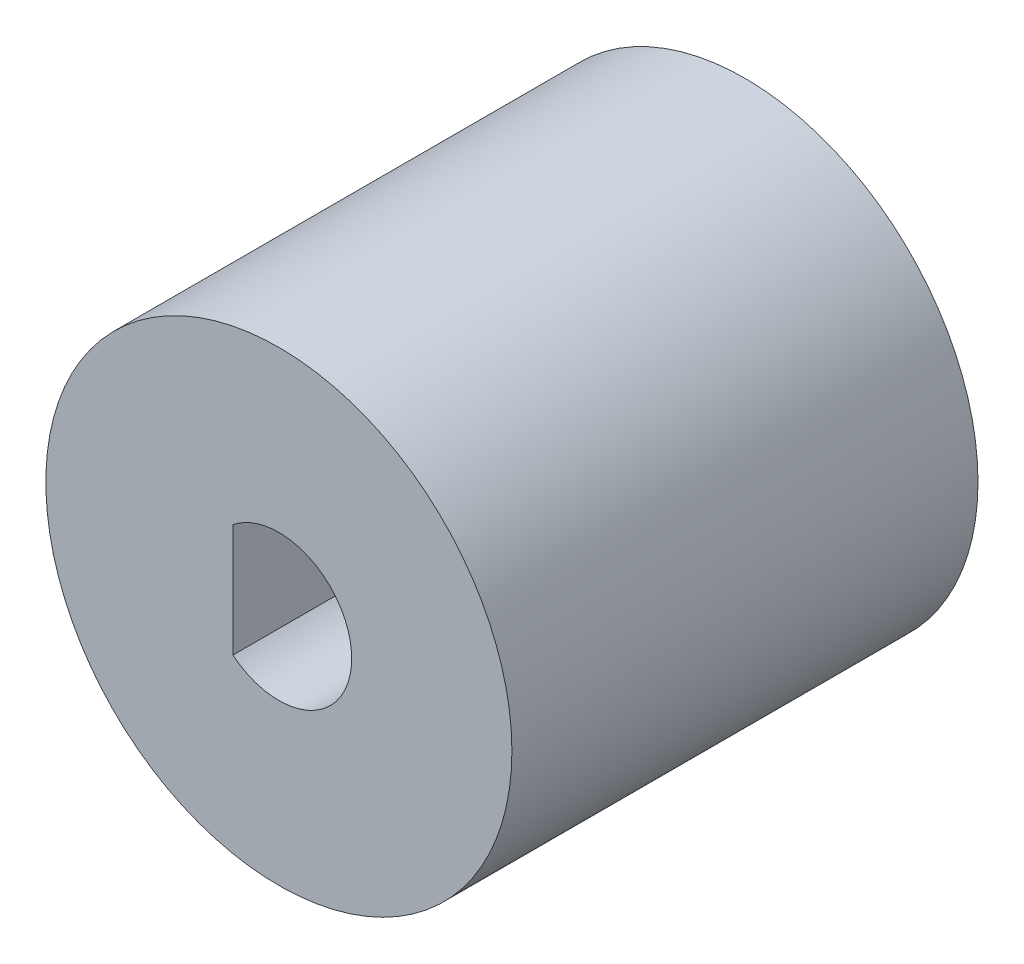
ISO-10303-21;
HEADER;
FILE_DESCRIPTION(('STEP AP214'),'2;1');
FILE_NAME('part.step','',(''),(''),'','','');
FILE_SCHEMA(('AUTOMOTIVE_DESIGN { 1 0 10303 214 1 1 1 1 }'));
ENDSEC;
DATA;
#1=APPLICATION_CONTEXT('core data for automotive mechanical design processes');
#2=APPLICATION_PROTOCOL_DEFINITION('international standard','automotive_design',2000,#1);
#3=PRODUCT_CONTEXT('',#1,'mechanical');
#4=PRODUCT('Part','Part','',(#3));
#5=PRODUCT_RELATED_PRODUCT_CATEGORY('part','',(#4));
#6=PRODUCT_DEFINITION_FORMATION('','',#4);
#7=PRODUCT_DEFINITION_CONTEXT('part definition',#1,'design');
#8=PRODUCT_DEFINITION('design','',#6,#7);
#9=PRODUCT_DEFINITION_SHAPE('','',#8);
#10=(LENGTH_UNIT() NAMED_UNIT(*) SI_UNIT(.MILLI.,.METRE.));
#11=(NAMED_UNIT(*) PLANE_ANGLE_UNIT() SI_UNIT($,.RADIAN.));
#12=(NAMED_UNIT(*) SI_UNIT($,.STERADIAN.) SOLID_ANGLE_UNIT());
#13=UNCERTAINTY_MEASURE_WITH_UNIT(LENGTH_MEASURE(1.E-05),#10,'distance_accuracy_value','');
#14=(GEOMETRIC_REPRESENTATION_CONTEXT(3) GLOBAL_UNCERTAINTY_ASSIGNED_CONTEXT((#13)) GLOBAL_UNIT_ASSIGNED_CONTEXT((#10,
#11,#12)) REPRESENTATION_CONTEXT('',''));
#15=CARTESIAN_POINT('',(0.,0.,0.));
#16=DIRECTION('',(0.,0.,1.));
#17=DIRECTION('',(1.,0.,0.));
#18=AXIS2_PLACEMENT_3D('',#15,#16,#17);
#19=CARTESIAN_POINT('',(0.,0.,16.));
#20=DIRECTION('',(0.,0.,-1.));
#21=DIRECTION('',(-1.,0.,0.));
#22=AXIS2_PLACEMENT_3D('',#19,#20,#21);
#23=CYLINDRICAL_SURFACE('',#22,8.);
#24=CARTESIAN_POINT('',(0.,0.,16.));
#25=DIRECTION('',(0.,0.,1.));
#26=DIRECTION('',(1.,0.,0.));
#27=AXIS2_PLACEMENT_3D('',#24,#25,#26);
#28=CIRCLE('',#27,8.);
#29=CARTESIAN_POINT('',(8.,0.,16.));
#30=VERTEX_POINT('',#29);
#31=EDGE_CURVE('E11',#30,#30,#28,.T.);
#32=ORIENTED_EDGE('',*,*,#31,.F.);
#33=EDGE_LOOP('',(#32));
#34=FACE_BOUND('',#33,.T.);
#35=CARTESIAN_POINT('',(0.,0.,0.));
#36=DIRECTION('',(0.,0.,1.));
#37=DIRECTION('',(1.,0.,0.));
#38=AXIS2_PLACEMENT_3D('',#35,#36,#37);
#39=CIRCLE('',#38,8.);
#40=CARTESIAN_POINT('',(8.,0.,0.));
#41=VERTEX_POINT('',#40);
#42=EDGE_CURVE('E39',#41,#41,#39,.T.);
#43=ORIENTED_EDGE('',*,*,#42,.T.);
#44=EDGE_LOOP('',(#43));
#45=FACE_BOUND('',#44,.T.);
#46=ADVANCED_FACE('F36',(#34,#45),#23,.T.);
#47=CARTESIAN_POINT('',(0.,0.,16.));
#48=DIRECTION('',(0.,0.,1.));
#49=DIRECTION('',(1.,0.,0.));
#50=AXIS2_PLACEMENT_3D('',#47,#48,#49);
#51=PLANE('',#50);
#52=CARTESIAN_POINT('',(0.,0.,16.));
#53=DIRECTION('',(0.,0.,1.));
#54=DIRECTION('',(-1.,0.,0.));
#55=AXIS2_PLACEMENT_3D('',#52,#53,#54);
#56=CIRCLE('',#55,2.5);
#57=CARTESIAN_POINT('',(-1.57894752611568,-1.93827880083676,16.));
#58=VERTEX_POINT('',#57);
#59=CARTESIAN_POINT('',(-1.57894752611568,1.93827880083676,16.));
#60=VERTEX_POINT('',#59);
#61=EDGE_CURVE('E55',#58,#60,#56,.T.);
#62=ORIENTED_EDGE('',*,*,#61,.F.);
#63=DIRECTION('',(0.,-1.,0.));
#64=VECTOR('',#63,1.);
#65=CARTESIAN_POINT('',(-1.57894752611568,-1.93827880083676,16.));
#66=LINE('',#65,#64);
#67=EDGE_CURVE('E87',#60,#58,#66,.T.);
#68=ORIENTED_EDGE('',*,*,#67,.F.);
#69=EDGE_LOOP('',(#62,#68));
#70=FACE_BOUND('',#69,.T.);
#71=ORIENTED_EDGE('',*,*,#31,.T.);
#72=EDGE_LOOP('',(#71));
#73=FACE_BOUND('',#72,.T.);
#74=ADVANCED_FACE('F128',(#70,#73),#51,.T.);
#75=CARTESIAN_POINT('',(0.,0.,0.));
#76=DIRECTION('',(0.,0.,1.));
#77=DIRECTION('',(1.,0.,0.));
#78=AXIS2_PLACEMENT_3D('',#75,#76,#77);
#79=PLANE('',#78);
#80=DIRECTION('',(0.,1.,0.));
#81=VECTOR('',#80,1.);
#82=CARTESIAN_POINT('',(-3.02055021716197,2.62226550631373,0.));
#83=LINE('',#82,#81);
#84=CARTESIAN_POINT('',(-3.02055021716197,-2.62226550631373,0.));
#85=VERTEX_POINT('',#84);
#86=CARTESIAN_POINT('',(-3.02055021716197,2.62226550631373,0.));
#87=VERTEX_POINT('',#86);
#88=EDGE_CURVE('E98',#85,#87,#83,.T.);
#89=ORIENTED_EDGE('',*,*,#88,.F.);
#90=CARTESIAN_POINT('',(0.,0.,0.));
#91=DIRECTION('',(0.,0.,-1.));
#92=DIRECTION('',(1.,0.,0.));
#93=AXIS2_PLACEMENT_3D('',#90,#91,#92);
#94=CIRCLE('',#93,4.);
#95=EDGE_CURVE('E92',#87,#85,#94,.T.);
#96=ORIENTED_EDGE('',*,*,#95,.F.);
#97=EDGE_LOOP('',(#89,#96));
#98=FACE_BOUND('',#97,.T.);
#99=ORIENTED_EDGE('',*,*,#42,.F.);
#100=EDGE_LOOP('',(#99));
#101=FACE_BOUND('',#100,.T.);
#102=ADVANCED_FACE('F116',(#98,#101),#79,.F.);
#103=CARTESIAN_POINT('',(0.,0.,8.));
#104=DIRECTION('',(0.,0.,-1.));
#105=DIRECTION('',(-1.,0.,0.));
#106=AXIS2_PLACEMENT_3D('',#103,#104,#105);
#107=CYLINDRICAL_SURFACE('',#106,4.);
#108=ORIENTED_EDGE('',*,*,#95,.T.);
#109=DIRECTION('',(0.,0.,-1.));
#110=VECTOR('',#109,1.);
#111=CARTESIAN_POINT('',(-3.02055021716197,-2.62226550631373,8.));
#112=LINE('',#111,#110);
#113=CARTESIAN_POINT('',(-3.02055021716197,-2.62226550631373,8.));
#114=VERTEX_POINT('',#113);
#115=EDGE_CURVE('E101',#114,#85,#112,.T.);
#116=ORIENTED_EDGE('',*,*,#115,.F.);
#117=CARTESIAN_POINT('',(0.,0.,8.));
#118=DIRECTION('',(0.,0.,-1.));
#119=DIRECTION('',(1.,0.,0.));
#120=AXIS2_PLACEMENT_3D('',#117,#118,#119);
#121=CIRCLE('',#120,4.);
#122=CARTESIAN_POINT('',(-3.02055021716197,2.62226550631373,8.));
#123=VERTEX_POINT('',#122);
#124=EDGE_CURVE('E94',#123,#114,#121,.T.);
#125=ORIENTED_EDGE('',*,*,#124,.F.);
#126=DIRECTION('',(0.,0.,-1.));
#127=VECTOR('',#126,1.);
#128=CARTESIAN_POINT('',(-3.02055021716197,2.62226550631373,8.));
#129=LINE('',#128,#127);
#130=EDGE_CURVE('E105',#123,#87,#129,.T.);
#131=ORIENTED_EDGE('',*,*,#130,.T.);
#132=EDGE_LOOP('',(#108,#116,#125,#131));
#133=FACE_BOUND('',#132,.T.);
#134=ADVANCED_FACE('F118',(#133),#107,.F.);
#135=CARTESIAN_POINT('',(-3.02055021716197,2.62226550631373,8.));
#136=DIRECTION('',(-1.,0.,0.));
#137=DIRECTION('',(0.,0.,1.));
#138=AXIS2_PLACEMENT_3D('',#135,#136,#137);
#139=PLANE('',#138);
#140=ORIENTED_EDGE('',*,*,#88,.T.);
#141=ORIENTED_EDGE('',*,*,#130,.F.);
#142=DIRECTION('',(0.,1.,0.));
#143=VECTOR('',#142,1.);
#144=CARTESIAN_POINT('',(-3.02055021716197,2.62226550631373,8.));
#145=LINE('',#144,#143);
#146=EDGE_CURVE('E97',#114,#123,#145,.T.);
#147=ORIENTED_EDGE('',*,*,#146,.F.);
#148=ORIENTED_EDGE('',*,*,#115,.T.);
#149=EDGE_LOOP('',(#140,#141,#147,#148));
#150=FACE_BOUND('',#149,.T.);
#151=ADVANCED_FACE('F111',(#150),#139,.F.);
#152=CARTESIAN_POINT('',(0.,0.,8.));
#153=DIRECTION('',(0.,0.,1.));
#154=DIRECTION('',(1.,0.,0.));
#155=AXIS2_PLACEMENT_3D('',#152,#153,#154);
#156=PLANE('',#155);
#157=DIRECTION('',(0.,-1.,0.));
#158=VECTOR('',#157,1.);
#159=CARTESIAN_POINT('',(-1.57894752611568,-1.93827880083676,8.));
#160=LINE('',#159,#158);
#161=CARTESIAN_POINT('',(-1.57894752611568,1.93827880083676,8.));
#162=VERTEX_POINT('',#161);
#163=CARTESIAN_POINT('',(-1.57894752611568,-1.93827880083676,8.));
#164=VERTEX_POINT('',#163);
#165=EDGE_CURVE('E79',#162,#164,#160,.T.);
#166=ORIENTED_EDGE('',*,*,#165,.T.);
#167=CARTESIAN_POINT('',(0.,0.,8.));
#168=DIRECTION('',(0.,0.,1.));
#169=DIRECTION('',(-1.,0.,0.));
#170=AXIS2_PLACEMENT_3D('',#167,#168,#169);
#171=CIRCLE('',#170,2.5);
#172=EDGE_CURVE('E50',#164,#162,#171,.T.);
#173=ORIENTED_EDGE('',*,*,#172,.T.);
#174=EDGE_LOOP('',(#166,#173));
#175=FACE_BOUND('',#174,.T.);
#176=ORIENTED_EDGE('',*,*,#124,.T.);
#177=ORIENTED_EDGE('',*,*,#146,.T.);
#178=EDGE_LOOP('',(#176,#177));
#179=FACE_BOUND('',#178,.T.);
#180=ADVANCED_FACE('F85',(#175,#179),#156,.F.);
#181=CARTESIAN_POINT('',(0.,0.,8.));
#182=DIRECTION('',(0.,0.,1.));
#183=DIRECTION('',(1.,0.,0.));
#184=AXIS2_PLACEMENT_3D('',#181,#182,#183);
#185=CYLINDRICAL_SURFACE('',#184,2.5);
#186=ORIENTED_EDGE('',*,*,#61,.T.);
#187=DIRECTION('',(0.,0.,1.));
#188=VECTOR('',#187,1.);
#189=CARTESIAN_POINT('',(-1.57894752611568,1.93827880083676,8.));
#190=LINE('',#189,#188);
#191=EDGE_CURVE('E72',#162,#60,#190,.T.);
#192=ORIENTED_EDGE('',*,*,#191,.F.);
#193=ORIENTED_EDGE('',*,*,#172,.F.);
#194=DIRECTION('',(0.,0.,1.));
#195=VECTOR('',#194,1.);
#196=CARTESIAN_POINT('',(-1.57894752611568,-1.93827880083676,8.));
#197=LINE('',#196,#195);
#198=EDGE_CURVE('E78',#164,#58,#197,.T.);
#199=ORIENTED_EDGE('',*,*,#198,.T.);
#200=EDGE_LOOP('',(#186,#192,#193,#199));
#201=FACE_BOUND('',#200,.T.);
#202=ADVANCED_FACE('F74',(#201),#185,.F.);
#203=CARTESIAN_POINT('',(-1.57894752611568,-1.93827880083676,8.));
#204=DIRECTION('',(-1.,0.,0.));
#205=DIRECTION('',(0.,0.,1.));
#206=AXIS2_PLACEMENT_3D('',#203,#204,#205);
#207=PLANE('',#206);
#208=ORIENTED_EDGE('',*,*,#67,.T.);
#209=ORIENTED_EDGE('',*,*,#198,.F.);
#210=ORIENTED_EDGE('',*,*,#165,.F.);
#211=ORIENTED_EDGE('',*,*,#191,.T.);
#212=EDGE_LOOP('',(#208,#209,#210,#211));
#213=FACE_BOUND('',#212,.T.);
#214=ADVANCED_FACE('F82',(#213),#207,.F.);
#215=CLOSED_SHELL('',(#46,#74,#102,#134,#151,#180,#202,#214));
#216=MANIFOLD_SOLID_BREP('B2',#215);
#217=ADVANCED_BREP_SHAPE_REPRESENTATION('',(#18,#216),#14);
#218=SHAPE_DEFINITION_REPRESENTATION(#9,#217);
ENDSEC;
END-ISO-10303-21;
